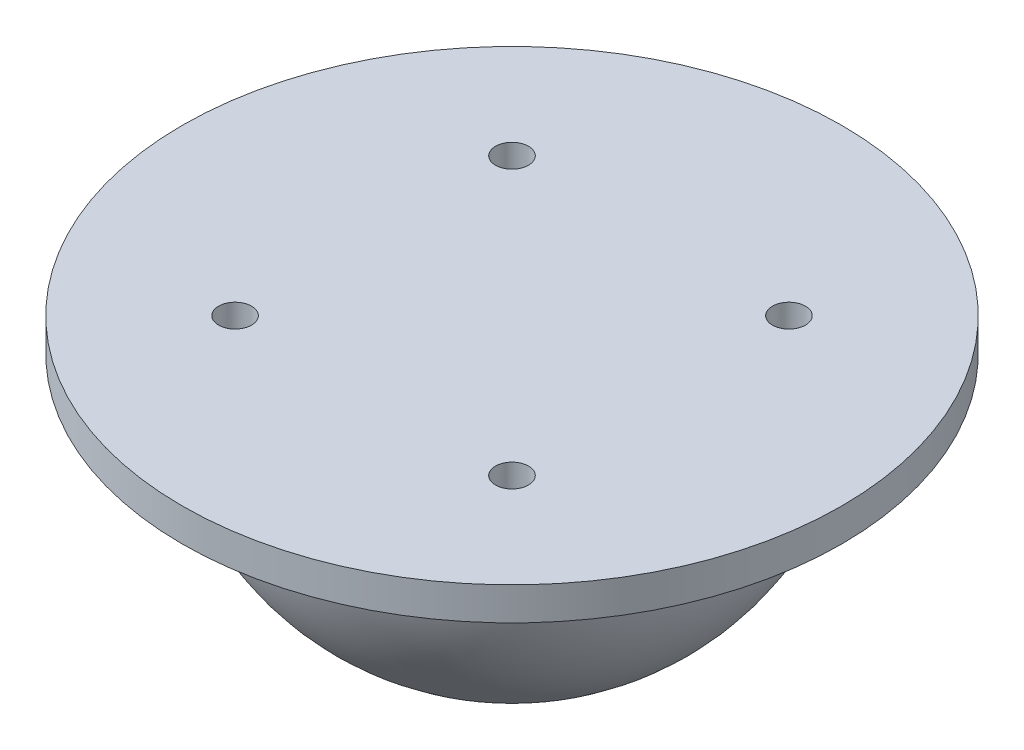
ISO-10303-21;
HEADER;
FILE_DESCRIPTION(('STEP AP214'),'2;1');
FILE_NAME('part.step','',(''),(''),'','','');
FILE_SCHEMA(('AUTOMOTIVE_DESIGN { 1 0 10303 214 1 1 1 1 }'));
ENDSEC;
DATA;
#1=APPLICATION_CONTEXT('core data for automotive mechanical design processes');
#2=APPLICATION_PROTOCOL_DEFINITION('international standard','automotive_design',2000,#1);
#3=PRODUCT_CONTEXT('',#1,'mechanical');
#4=PRODUCT('Part','Part','',(#3));
#5=PRODUCT_RELATED_PRODUCT_CATEGORY('part','',(#4));
#6=PRODUCT_DEFINITION_FORMATION('','',#4);
#7=PRODUCT_DEFINITION_CONTEXT('part definition',#1,'design');
#8=PRODUCT_DEFINITION('design','',#6,#7);
#9=PRODUCT_DEFINITION_SHAPE('','',#8);
#10=(LENGTH_UNIT() NAMED_UNIT(*) SI_UNIT(.MILLI.,.METRE.));
#11=(NAMED_UNIT(*) PLANE_ANGLE_UNIT() SI_UNIT($,.RADIAN.));
#12=(NAMED_UNIT(*) SI_UNIT($,.STERADIAN.) SOLID_ANGLE_UNIT());
#13=UNCERTAINTY_MEASURE_WITH_UNIT(LENGTH_MEASURE(1.E-05),#10,'distance_accuracy_value','');
#14=(GEOMETRIC_REPRESENTATION_CONTEXT(3) GLOBAL_UNCERTAINTY_ASSIGNED_CONTEXT((#13)) GLOBAL_UNIT_ASSIGNED_CONTEXT((#10,
#11,#12)) REPRESENTATION_CONTEXT('',''));
#15=CARTESIAN_POINT('',(0.,0.,0.));
#16=DIRECTION('',(0.,0.,1.));
#17=DIRECTION('',(1.,0.,0.));
#18=AXIS2_PLACEMENT_3D('',#15,#16,#17);
#19=CARTESIAN_POINT('',(0.,3.,0.));
#20=DIRECTION('',(0.,1.,0.));
#21=DIRECTION('',(0.,0.,1.));
#22=AXIS2_PLACEMENT_3D('',#19,#20,#21);
#23=PLANE('',#22);
#24=CARTESIAN_POINT('',(12.6,3.,12.6));
#25=DIRECTION('',(0.,1.,0.));
#26=DIRECTION('',(0.,0.,1.));
#27=AXIS2_PLACEMENT_3D('',#24,#25,#26);
#28=CIRCLE('',#27,1.5);
#29=CARTESIAN_POINT('',(12.6,3.,14.1));
#30=VERTEX_POINT('',#29);
#31=EDGE_CURVE('E74',#30,#30,#28,.T.);
#32=ORIENTED_EDGE('',*,*,#31,.F.);
#33=EDGE_LOOP('',(#32));
#34=FACE_BOUND('',#33,.T.);
#35=CARTESIAN_POINT('',(-12.6,3.,-12.6));
#36=DIRECTION('',(0.,1.,0.));
#37=DIRECTION('',(0.,0.,1.));
#38=AXIS2_PLACEMENT_3D('',#35,#36,#37);
#39=CIRCLE('',#38,1.5);
#40=CARTESIAN_POINT('',(-12.6,3.,-11.1));
#41=VERTEX_POINT('',#40);
#42=EDGE_CURVE('E60',#41,#41,#39,.T.);
#43=ORIENTED_EDGE('',*,*,#42,.F.);
#44=EDGE_LOOP('',(#43));
#45=FACE_BOUND('',#44,.T.);
#46=CARTESIAN_POINT('',(0.,3.,0.));
#47=DIRECTION('',(0.,1.,0.));
#48=DIRECTION('',(0.,0.,1.));
#49=AXIS2_PLACEMENT_3D('',#46,#47,#48);
#50=CIRCLE('',#49,30.);
#51=CARTESIAN_POINT('',(0.,3.,30.));
#52=VERTEX_POINT('',#51);
#53=EDGE_CURVE('E10',#52,#52,#50,.T.);
#54=ORIENTED_EDGE('',*,*,#53,.T.);
#55=EDGE_LOOP('',(#54));
#56=FACE_BOUND('',#55,.T.);
#57=CARTESIAN_POINT('',(12.6,3.,-12.6));
#58=DIRECTION('',(0.,1.,0.));
#59=DIRECTION('',(0.,0.,-1.));
#60=AXIS2_PLACEMENT_3D('',#57,#58,#59);
#61=CIRCLE('',#60,1.5);
#62=CARTESIAN_POINT('',(12.6,3.,-14.1));
#63=VERTEX_POINT('',#62);
#64=EDGE_CURVE('E66',#63,#63,#61,.T.);
#65=ORIENTED_EDGE('',*,*,#64,.F.);
#66=EDGE_LOOP('',(#65));
#67=FACE_BOUND('',#66,.T.);
#68=CARTESIAN_POINT('',(-12.6,3.,12.6));
#69=DIRECTION('',(0.,1.,0.));
#70=DIRECTION('',(0.,0.,-1.));
#71=AXIS2_PLACEMENT_3D('',#68,#69,#70);
#72=CIRCLE('',#71,1.5);
#73=CARTESIAN_POINT('',(-12.6,3.,11.1));
#74=VERTEX_POINT('',#73);
#75=EDGE_CURVE('E82',#74,#74,#72,.T.);
#76=ORIENTED_EDGE('',*,*,#75,.F.);
#77=EDGE_LOOP('',(#76));
#78=FACE_BOUND('',#77,.T.);
#79=ADVANCED_FACE('F45',(#34,#45,#56,#67,#78),#23,.T.);
#80=CARTESIAN_POINT('',(0.,0.,0.));
#81=DIRECTION('',(0.,1.,0.));
#82=DIRECTION('',(0.,0.,1.));
#83=AXIS2_PLACEMENT_3D('',#80,#81,#82);
#84=PLANE('',#83);
#85=CARTESIAN_POINT('',(0.,0.,0.));
#86=DIRECTION('',(0.,-1.,0.));
#87=DIRECTION('',(0.,0.,-1.));
#88=AXIS2_PLACEMENT_3D('',#85,#86,#87);
#89=CIRCLE('',#88,22.5);
#90=CARTESIAN_POINT('',(0.,0.,-22.5));
#91=VERTEX_POINT('',#90);
#92=EDGE_CURVE('E90',#91,#91,#89,.T.);
#93=ORIENTED_EDGE('',*,*,#92,.F.);
#94=EDGE_LOOP('',(#93));
#95=FACE_BOUND('',#94,.T.);
#96=CARTESIAN_POINT('',(0.,0.,0.));
#97=DIRECTION('',(0.,1.,0.));
#98=DIRECTION('',(0.,0.,1.));
#99=AXIS2_PLACEMENT_3D('',#96,#97,#98);
#100=CIRCLE('',#99,30.);
#101=CARTESIAN_POINT('',(0.,0.,30.));
#102=VERTEX_POINT('',#101);
#103=EDGE_CURVE('E49',#102,#102,#100,.T.);
#104=ORIENTED_EDGE('',*,*,#103,.F.);
#105=EDGE_LOOP('',(#104));
#106=FACE_BOUND('',#105,.T.);
#107=ADVANCED_FACE('F102',(#95,#106),#84,.F.);
#108=CARTESIAN_POINT('',(0.,3.,0.));
#109=DIRECTION('',(0.,-1.,0.));
#110=DIRECTION('',(0.,0.,-1.));
#111=AXIS2_PLACEMENT_3D('',#108,#109,#110);
#112=CYLINDRICAL_SURFACE('',#111,30.);
#113=ORIENTED_EDGE('',*,*,#53,.F.);
#114=EDGE_LOOP('',(#113));
#115=FACE_BOUND('',#114,.T.);
#116=ORIENTED_EDGE('',*,*,#103,.T.);
#117=EDGE_LOOP('',(#116));
#118=FACE_BOUND('',#117,.T.);
#119=ADVANCED_FACE('F47',(#115,#118),#112,.T.);
#120=CARTESIAN_POINT('',(-12.6,3.,-12.6));
#121=DIRECTION('',(0.,-1.,0.));
#122=DIRECTION('',(0.,0.,-1.));
#123=AXIS2_PLACEMENT_3D('',#120,#121,#122);
#124=CYLINDRICAL_SURFACE('',#123,1.5);
#125=ORIENTED_EDGE('',*,*,#42,.T.);
#126=EDGE_LOOP('',(#125));
#127=FACE_BOUND('',#126,.T.);
#128=CARTESIAN_POINT('',(-12.6,0.,-12.6));
#129=DIRECTION('',(0.,1.,0.));
#130=DIRECTION('',(0.,0.,1.));
#131=AXIS2_PLACEMENT_3D('',#128,#129,#130);
#132=CIRCLE('',#131,1.5);
#133=CARTESIAN_POINT('',(-12.6,0.,-11.1));
#134=VERTEX_POINT('',#133);
#135=EDGE_CURVE('E62',#134,#134,#132,.T.);
#136=ORIENTED_EDGE('',*,*,#135,.F.);
#137=EDGE_LOOP('',(#136));
#138=FACE_BOUND('',#137,.T.);
#139=ADVANCED_FACE('F108',(#127,#138),#124,.F.);
#140=CARTESIAN_POINT('',(12.6,3.,-12.6));
#141=DIRECTION('',(0.,-1.,0.));
#142=DIRECTION('',(0.,0.,-1.));
#143=AXIS2_PLACEMENT_3D('',#140,#141,#142);
#144=CYLINDRICAL_SURFACE('',#143,1.5);
#145=ORIENTED_EDGE('',*,*,#64,.T.);
#146=EDGE_LOOP('',(#145));
#147=FACE_BOUND('',#146,.T.);
#148=CARTESIAN_POINT('',(12.6,0.,-12.6));
#149=DIRECTION('',(0.,1.,0.));
#150=DIRECTION('',(0.,0.,-1.));
#151=AXIS2_PLACEMENT_3D('',#148,#149,#150);
#152=CIRCLE('',#151,1.5);
#153=CARTESIAN_POINT('',(12.6,0.,-14.1));
#154=VERTEX_POINT('',#153);
#155=EDGE_CURVE('E70',#154,#154,#152,.T.);
#156=ORIENTED_EDGE('',*,*,#155,.F.);
#157=EDGE_LOOP('',(#156));
#158=FACE_BOUND('',#157,.T.);
#159=ADVANCED_FACE('F114',(#147,#158),#144,.F.);
#160=CARTESIAN_POINT('',(12.6,3.,12.6));
#161=DIRECTION('',(0.,-1.,0.));
#162=DIRECTION('',(0.,0.,-1.));
#163=AXIS2_PLACEMENT_3D('',#160,#161,#162);
#164=CYLINDRICAL_SURFACE('',#163,1.5);
#165=ORIENTED_EDGE('',*,*,#31,.T.);
#166=EDGE_LOOP('',(#165));
#167=FACE_BOUND('',#166,.T.);
#168=CARTESIAN_POINT('',(12.6,0.,12.6));
#169=DIRECTION('',(0.,1.,0.));
#170=DIRECTION('',(0.,0.,1.));
#171=AXIS2_PLACEMENT_3D('',#168,#169,#170);
#172=CIRCLE('',#171,1.5);
#173=CARTESIAN_POINT('',(12.6,0.,14.1));
#174=VERTEX_POINT('',#173);
#175=EDGE_CURVE('E78',#174,#174,#172,.T.);
#176=ORIENTED_EDGE('',*,*,#175,.F.);
#177=EDGE_LOOP('',(#176));
#178=FACE_BOUND('',#177,.T.);
#179=ADVANCED_FACE('F126',(#167,#178),#164,.F.);
#180=CARTESIAN_POINT('',(-12.6,3.,12.6));
#181=DIRECTION('',(0.,-1.,0.));
#182=DIRECTION('',(0.,0.,-1.));
#183=AXIS2_PLACEMENT_3D('',#180,#181,#182);
#184=CYLINDRICAL_SURFACE('',#183,1.5);
#185=ORIENTED_EDGE('',*,*,#75,.T.);
#186=EDGE_LOOP('',(#185));
#187=FACE_BOUND('',#186,.T.);
#188=CARTESIAN_POINT('',(-12.6,0.,12.6));
#189=DIRECTION('',(0.,1.,0.));
#190=DIRECTION('',(0.,0.,-1.));
#191=AXIS2_PLACEMENT_3D('',#188,#189,#190);
#192=CIRCLE('',#191,1.5);
#193=CARTESIAN_POINT('',(-12.6,0.,11.1));
#194=VERTEX_POINT('',#193);
#195=EDGE_CURVE('E86',#194,#194,#192,.T.);
#196=ORIENTED_EDGE('',*,*,#195,.F.);
#197=EDGE_LOOP('',(#196));
#198=FACE_BOUND('',#197,.T.);
#199=ADVANCED_FACE('F130',(#187,#198),#184,.F.);
#200=CARTESIAN_POINT('',(0.,0.,0.));
#201=DIRECTION('',(0.,-1.,0.));
#202=DIRECTION('',(0.,0.,-1.));
#203=AXIS2_PLACEMENT_3D('',#200,#201,#202);
#204=PLANE('',#203);
#205=ORIENTED_EDGE('',*,*,#195,.T.);
#206=EDGE_LOOP('',(#205));
#207=FACE_BOUND('',#206,.T.);
#208=ADVANCED_FACE('F134',(#207),#204,.F.);
#209=ORIENTED_EDGE('',*,*,#175,.T.);
#210=EDGE_LOOP('',(#209));
#211=FACE_BOUND('',#210,.T.);
#212=ADVANCED_FACE('F145',(#211),#204,.F.);
#213=ORIENTED_EDGE('',*,*,#155,.T.);
#214=EDGE_LOOP('',(#213));
#215=FACE_BOUND('',#214,.T.);
#216=ADVANCED_FACE('F140',(#215),#204,.F.);
#217=ORIENTED_EDGE('',*,*,#135,.T.);
#218=EDGE_LOOP('',(#217));
#219=FACE_BOUND('',#218,.T.);
#220=ADVANCED_FACE('F138',(#219),#204,.F.);
#221=CARTESIAN_POINT('',(0.,0.,0.));
#222=DIRECTION('',(0.,-1.,0.));
#223=DIRECTION('',(0.,0.,1.));
#224=AXIS2_PLACEMENT_3D('',#221,#222,#223);
#225=SPHERICAL_SURFACE('',#224,22.5);
#226=ORIENTED_EDGE('',*,*,#92,.T.);
#227=EDGE_LOOP('',(#226));
#228=FACE_BOUND('',#227,.T.);
#229=ADVANCED_FACE('F100',(#228),#225,.T.);
#230=CLOSED_SHELL('',(#79,#107,#119,#139,#159,#179,#199,#208,#212,#216,#220,#229));
#231=MANIFOLD_SOLID_BREP('B2',#230);
#232=ADVANCED_BREP_SHAPE_REPRESENTATION('',(#18,#231),#14);
#233=SHAPE_DEFINITION_REPRESENTATION(#9,#232);
ENDSEC;
END-ISO-10303-21;
